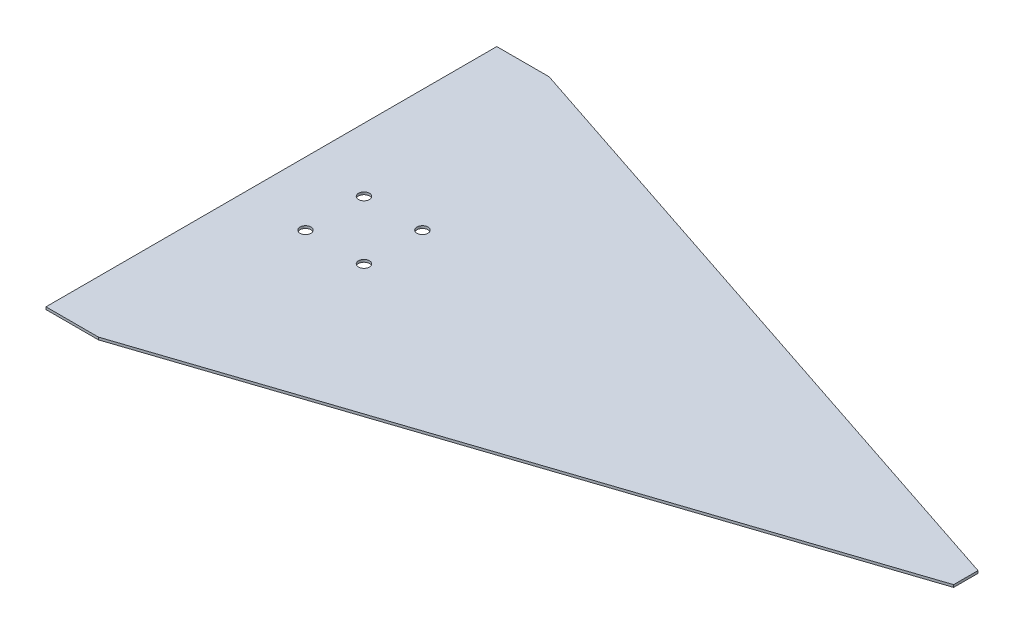
ISO-10303-21;
HEADER;
FILE_DESCRIPTION(('STEP AP214'),'2;1');
FILE_NAME('part.step','',(''),(''),'','','');
FILE_SCHEMA(('AUTOMOTIVE_DESIGN { 1 0 10303 214 1 1 1 1 }'));
ENDSEC;
DATA;
#1=APPLICATION_CONTEXT('core data for automotive mechanical design processes');
#2=APPLICATION_PROTOCOL_DEFINITION('international standard','automotive_design',2000,#1);
#3=PRODUCT_CONTEXT('',#1,'mechanical');
#4=PRODUCT('Part','Part','',(#3));
#5=PRODUCT_RELATED_PRODUCT_CATEGORY('part','',(#4));
#6=PRODUCT_DEFINITION_FORMATION('','',#4);
#7=PRODUCT_DEFINITION_CONTEXT('part definition',#1,'design');
#8=PRODUCT_DEFINITION('design','',#6,#7);
#9=PRODUCT_DEFINITION_SHAPE('','',#8);
#10=(LENGTH_UNIT() NAMED_UNIT(*) SI_UNIT(.MILLI.,.METRE.));
#11=(NAMED_UNIT(*) PLANE_ANGLE_UNIT() SI_UNIT($,.RADIAN.));
#12=(NAMED_UNIT(*) SI_UNIT($,.STERADIAN.) SOLID_ANGLE_UNIT());
#13=UNCERTAINTY_MEASURE_WITH_UNIT(LENGTH_MEASURE(1.E-05),#10,'distance_accuracy_value','');
#14=(GEOMETRIC_REPRESENTATION_CONTEXT(3) GLOBAL_UNCERTAINTY_ASSIGNED_CONTEXT((#13)) GLOBAL_UNIT_ASSIGNED_CONTEXT((#10,
#11,#12)) REPRESENTATION_CONTEXT('',''));
#15=CARTESIAN_POINT('',(0.,0.,0.));
#16=DIRECTION('',(0.,0.,1.));
#17=DIRECTION('',(1.,0.,0.));
#18=AXIS2_PLACEMENT_3D('',#15,#16,#17);
#19=CARTESIAN_POINT('',(0.,1.,92.5));
#20=DIRECTION('',(0.,0.,-1.));
#21=DIRECTION('',(-1.,0.,0.));
#22=AXIS2_PLACEMENT_3D('',#19,#20,#21);
#23=PLANE('',#22);
#24=DIRECTION('',(1.,0.,0.));
#25=VECTOR('',#24,1.);
#26=CARTESIAN_POINT('',(0.,0.,92.5));
#27=LINE('',#26,#25);
#28=CARTESIAN_POINT('',(-142.5,0.,92.5));
#29=VERTEX_POINT('',#28);
#30=CARTESIAN_POINT('',(-121.,0.,92.5));
#31=VERTEX_POINT('',#30);
#32=EDGE_CURVE('E115',#29,#31,#27,.T.);
#33=ORIENTED_EDGE('',*,*,#32,.T.);
#34=DIRECTION('',(0.,-1.,0.));
#35=VECTOR('',#34,1.);
#36=CARTESIAN_POINT('',(-121.,1.,92.5));
#37=LINE('',#36,#35);
#38=CARTESIAN_POINT('',(-121.,1.,92.5));
#39=VERTEX_POINT('',#38);
#40=EDGE_CURVE('E11',#39,#31,#37,.T.);
#41=ORIENTED_EDGE('',*,*,#40,.F.);
#42=DIRECTION('',(1.,0.,0.));
#43=VECTOR('',#42,1.);
#44=CARTESIAN_POINT('',(0.,1.,92.5));
#45=LINE('',#44,#43);
#46=CARTESIAN_POINT('',(-142.5,1.,92.5));
#47=VERTEX_POINT('',#46);
#48=EDGE_CURVE('E129',#47,#39,#45,.T.);
#49=ORIENTED_EDGE('',*,*,#48,.F.);
#50=DIRECTION('',(0.,-1.,0.));
#51=VECTOR('',#50,1.);
#52=CARTESIAN_POINT('',(-142.5,1.,92.5));
#53=LINE('',#52,#51);
#54=EDGE_CURVE('E111',#47,#29,#53,.T.);
#55=ORIENTED_EDGE('',*,*,#54,.T.);
#56=EDGE_LOOP('',(#33,#41,#49,#55));
#57=FACE_BOUND('',#56,.T.);
#58=ADVANCED_FACE('F33',(#57),#23,.F.);
#59=CARTESIAN_POINT('',(15.6482079039027,1.,47.1234603734669));
#60=DIRECTION('',(-0.315147056715353,0.,-0.949042850794236));
#61=DIRECTION('',(-0.949042850794236,0.,0.315147056715353));
#62=AXIS2_PLACEMENT_3D('',#59,#60,#61);
#63=PLANE('',#62);
#64=DIRECTION('',(0.949042850794236,0.,-0.315147056715353));
#65=VECTOR('',#64,1.);
#66=CARTESIAN_POINT('',(15.6482079039027,0.,47.1234603734669));
#67=LINE('',#66,#65);
#68=CARTESIAN_POINT('',(142.5,0.,5.));
#69=VERTEX_POINT('',#68);
#70=EDGE_CURVE('E118',#31,#69,#67,.T.);
#71=ORIENTED_EDGE('',*,*,#70,.T.);
#72=DIRECTION('',(0.,-1.,0.));
#73=VECTOR('',#72,1.);
#74=CARTESIAN_POINT('',(142.5,1.,5.));
#75=LINE('',#74,#73);
#76=CARTESIAN_POINT('',(142.5,1.,5.));
#77=VERTEX_POINT('',#76);
#78=EDGE_CURVE('E41',#77,#69,#75,.T.);
#79=ORIENTED_EDGE('',*,*,#78,.F.);
#80=DIRECTION('',(0.949042850794236,0.,-0.315147056715353));
#81=VECTOR('',#80,1.);
#82=CARTESIAN_POINT('',(15.6482079039027,1.,47.1234603734669));
#83=LINE('',#82,#81);
#84=EDGE_CURVE('E82',#39,#77,#83,.T.);
#85=ORIENTED_EDGE('',*,*,#84,.F.);
#86=ORIENTED_EDGE('',*,*,#40,.T.);
#87=EDGE_LOOP('',(#71,#79,#85,#86));
#88=FACE_BOUND('',#87,.T.);
#89=ADVANCED_FACE('F135',(#88),#63,.F.);
#90=CARTESIAN_POINT('',(142.5,1.,0.));
#91=DIRECTION('',(1.,0.,0.));
#92=DIRECTION('',(0.,0.,-1.));
#93=AXIS2_PLACEMENT_3D('',#90,#91,#92);
#94=PLANE('',#93);
#95=DIRECTION('',(0.,0.,1.));
#96=VECTOR('',#95,1.);
#97=CARTESIAN_POINT('',(142.5,0.,0.));
#98=LINE('',#97,#96);
#99=CARTESIAN_POINT('',(142.5,0.,-4.99999999999999));
#100=VERTEX_POINT('',#99);
#101=EDGE_CURVE('E122',#100,#69,#98,.T.);
#102=ORIENTED_EDGE('',*,*,#101,.F.);
#103=DIRECTION('',(0.,-1.,0.));
#104=VECTOR('',#103,1.);
#105=CARTESIAN_POINT('',(142.5,1.,-4.99999999999999));
#106=LINE('',#105,#104);
#107=CARTESIAN_POINT('',(142.5,1.,-4.99999999999999));
#108=VERTEX_POINT('',#107);
#109=EDGE_CURVE('E101',#108,#100,#106,.T.);
#110=ORIENTED_EDGE('',*,*,#109,.F.);
#111=DIRECTION('',(0.,0.,1.));
#112=VECTOR('',#111,1.);
#113=CARTESIAN_POINT('',(142.5,1.,0.));
#114=LINE('',#113,#112);
#115=EDGE_CURVE('E107',#108,#77,#114,.T.);
#116=ORIENTED_EDGE('',*,*,#115,.T.);
#117=ORIENTED_EDGE('',*,*,#78,.T.);
#118=EDGE_LOOP('',(#102,#110,#116,#117));
#119=FACE_BOUND('',#118,.T.);
#120=ADVANCED_FACE('F134',(#119),#94,.T.);
#121=CARTESIAN_POINT('',(15.6482079039027,1.,-47.1234603734669));
#122=DIRECTION('',(0.315147056715353,0.,-0.949042850794236));
#123=DIRECTION('',(-0.949042850794236,0.,-0.315147056715353));
#124=AXIS2_PLACEMENT_3D('',#121,#122,#123);
#125=PLANE('',#124);
#126=DIRECTION('',(0.949042850794236,0.,0.315147056715353));
#127=VECTOR('',#126,1.);
#128=CARTESIAN_POINT('',(15.6482079039027,0.,-47.1234603734669));
#129=LINE('',#128,#127);
#130=CARTESIAN_POINT('',(-121.,0.,-92.5));
#131=VERTEX_POINT('',#130);
#132=EDGE_CURVE('E96',#131,#100,#129,.T.);
#133=ORIENTED_EDGE('',*,*,#132,.F.);
#134=DIRECTION('',(0.,-1.,0.));
#135=VECTOR('',#134,1.);
#136=CARTESIAN_POINT('',(-121.,1.,-92.5));
#137=LINE('',#136,#135);
#138=CARTESIAN_POINT('',(-121.,1.,-92.5));
#139=VERTEX_POINT('',#138);
#140=EDGE_CURVE('E91',#139,#131,#137,.T.);
#141=ORIENTED_EDGE('',*,*,#140,.F.);
#142=DIRECTION('',(0.949042850794236,0.,0.315147056715353));
#143=VECTOR('',#142,1.);
#144=CARTESIAN_POINT('',(15.6482079039027,1.,-47.1234603734669));
#145=LINE('',#144,#143);
#146=EDGE_CURVE('E94',#139,#108,#145,.T.);
#147=ORIENTED_EDGE('',*,*,#146,.T.);
#148=ORIENTED_EDGE('',*,*,#109,.T.);
#149=EDGE_LOOP('',(#133,#141,#147,#148));
#150=FACE_BOUND('',#149,.T.);
#151=ADVANCED_FACE('F93',(#150),#125,.T.);
#152=CARTESIAN_POINT('',(0.,1.,-92.5));
#153=DIRECTION('',(0.,0.,-1.));
#154=DIRECTION('',(-1.,0.,0.));
#155=AXIS2_PLACEMENT_3D('',#152,#153,#154);
#156=PLANE('',#155);
#157=DIRECTION('',(1.,0.,0.));
#158=VECTOR('',#157,1.);
#159=CARTESIAN_POINT('',(0.,0.,-92.5));
#160=LINE('',#159,#158);
#161=CARTESIAN_POINT('',(-142.5,0.,-92.5));
#162=VERTEX_POINT('',#161);
#163=EDGE_CURVE('E126',#162,#131,#160,.T.);
#164=ORIENTED_EDGE('',*,*,#163,.F.);
#165=DIRECTION('',(0.,-1.,0.));
#166=VECTOR('',#165,1.);
#167=CARTESIAN_POINT('',(-142.5,1.,-92.5));
#168=LINE('',#167,#166);
#169=CARTESIAN_POINT('',(-142.5,1.,-92.5));
#170=VERTEX_POINT('',#169);
#171=EDGE_CURVE('E71',#170,#162,#168,.T.);
#172=ORIENTED_EDGE('',*,*,#171,.F.);
#173=DIRECTION('',(1.,0.,0.));
#174=VECTOR('',#173,1.);
#175=CARTESIAN_POINT('',(0.,1.,-92.5));
#176=LINE('',#175,#174);
#177=EDGE_CURVE('E105',#170,#139,#176,.T.);
#178=ORIENTED_EDGE('',*,*,#177,.T.);
#179=ORIENTED_EDGE('',*,*,#140,.T.);
#180=EDGE_LOOP('',(#164,#172,#178,#179));
#181=FACE_BOUND('',#180,.T.);
#182=ADVANCED_FACE('F109',(#181),#156,.T.);
#183=CARTESIAN_POINT('',(-142.5,1.,0.));
#184=DIRECTION('',(1.,0.,0.));
#185=DIRECTION('',(0.,0.,-1.));
#186=AXIS2_PLACEMENT_3D('',#183,#184,#185);
#187=PLANE('',#186);
#188=DIRECTION('',(0.,0.,1.));
#189=VECTOR('',#188,1.);
#190=CARTESIAN_POINT('',(-142.5,0.,0.));
#191=LINE('',#190,#189);
#192=EDGE_CURVE('E74',#162,#29,#191,.T.);
#193=ORIENTED_EDGE('',*,*,#192,.T.);
#194=ORIENTED_EDGE('',*,*,#54,.F.);
#195=DIRECTION('',(0.,0.,1.));
#196=VECTOR('',#195,1.);
#197=CARTESIAN_POINT('',(-142.5,1.,0.));
#198=LINE('',#197,#196);
#199=EDGE_CURVE('E49',#170,#47,#198,.T.);
#200=ORIENTED_EDGE('',*,*,#199,.F.);
#201=ORIENTED_EDGE('',*,*,#171,.T.);
#202=EDGE_LOOP('',(#193,#194,#200,#201));
#203=FACE_BOUND('',#202,.T.);
#204=ADVANCED_FACE('F142',(#203),#187,.F.);
#205=CARTESIAN_POINT('',(0.,1.,0.));
#206=DIRECTION('',(0.,1.,0.));
#207=DIRECTION('',(0.,0.,1.));
#208=AXIS2_PLACEMENT_3D('',#205,#206,#207);
#209=PLANE('',#208);
#210=CARTESIAN_POINT('',(-92.5,1.,-12.));
#211=DIRECTION('',(0.,1.,0.));
#212=DIRECTION('',(0.,0.,1.));
#213=AXIS2_PLACEMENT_3D('',#210,#211,#212);
#214=CIRCLE('',#213,2.25);
#215=CARTESIAN_POINT('',(-92.5,1.,-9.75000000000001));
#216=VERTEX_POINT('',#215);
#217=EDGE_CURVE('E237',#216,#216,#214,.T.);
#218=ORIENTED_EDGE('',*,*,#217,.F.);
#219=EDGE_LOOP('',(#218));
#220=FACE_BOUND('',#219,.T.);
#221=CARTESIAN_POINT('',(-116.5,1.,12.));
#222=DIRECTION('',(0.,1.,0.));
#223=DIRECTION('',(0.,0.,1.));
#224=AXIS2_PLACEMENT_3D('',#221,#222,#223);
#225=CIRCLE('',#224,2.25);
#226=CARTESIAN_POINT('',(-116.5,1.,14.25));
#227=VERTEX_POINT('',#226);
#228=EDGE_CURVE('E243',#227,#227,#225,.T.);
#229=ORIENTED_EDGE('',*,*,#228,.F.);
#230=EDGE_LOOP('',(#229));
#231=FACE_BOUND('',#230,.T.);
#232=CARTESIAN_POINT('',(-92.5,1.,12.));
#233=DIRECTION('',(0.,1.,0.));
#234=DIRECTION('',(0.,0.,1.));
#235=AXIS2_PLACEMENT_3D('',#232,#233,#234);
#236=CIRCLE('',#235,2.25);
#237=CARTESIAN_POINT('',(-92.5,1.,14.25));
#238=VERTEX_POINT('',#237);
#239=EDGE_CURVE('E263',#238,#238,#236,.T.);
#240=ORIENTED_EDGE('',*,*,#239,.F.);
#241=EDGE_LOOP('',(#240));
#242=FACE_BOUND('',#241,.T.);
#243=CARTESIAN_POINT('',(-116.5,1.,-12.));
#244=DIRECTION('',(0.,1.,0.));
#245=DIRECTION('',(0.,0.,1.));
#246=AXIS2_PLACEMENT_3D('',#243,#244,#245);
#247=CIRCLE('',#246,2.25);
#248=CARTESIAN_POINT('',(-116.5,1.,-9.75000000000001));
#249=VERTEX_POINT('',#248);
#250=EDGE_CURVE('E240',#249,#249,#247,.T.);
#251=ORIENTED_EDGE('',*,*,#250,.F.);
#252=EDGE_LOOP('',(#251));
#253=FACE_BOUND('',#252,.T.);
#254=ORIENTED_EDGE('',*,*,#48,.T.);
#255=ORIENTED_EDGE('',*,*,#84,.T.);
#256=ORIENTED_EDGE('',*,*,#115,.F.);
#257=ORIENTED_EDGE('',*,*,#146,.F.);
#258=ORIENTED_EDGE('',*,*,#177,.F.);
#259=ORIENTED_EDGE('',*,*,#199,.T.);
#260=EDGE_LOOP('',(#254,#255,#256,#257,#258,#259));
#261=FACE_BOUND('',#260,.T.);
#262=ADVANCED_FACE('F104',(#220,#231,#242,#253,#261),#209,.T.);
#263=CARTESIAN_POINT('',(0.,0.,0.));
#264=DIRECTION('',(0.,1.,0.));
#265=DIRECTION('',(0.,0.,1.));
#266=AXIS2_PLACEMENT_3D('',#263,#264,#265);
#267=PLANE('',#266);
#268=CARTESIAN_POINT('',(-92.5,0.,-12.));
#269=DIRECTION('',(0.,1.,0.));
#270=DIRECTION('',(0.,0.,1.));
#271=AXIS2_PLACEMENT_3D('',#268,#269,#270);
#272=CIRCLE('',#271,2.25);
#273=CARTESIAN_POINT('',(-92.5,0.,-9.75000000000001));
#274=VERTEX_POINT('',#273);
#275=EDGE_CURVE('E234',#274,#274,#272,.T.);
#276=ORIENTED_EDGE('',*,*,#275,.T.);
#277=EDGE_LOOP('',(#276));
#278=FACE_BOUND('',#277,.T.);
#279=CARTESIAN_POINT('',(-116.5,0.,12.));
#280=DIRECTION('',(0.,1.,0.));
#281=DIRECTION('',(0.,0.,1.));
#282=AXIS2_PLACEMENT_3D('',#279,#280,#281);
#283=CIRCLE('',#282,2.25);
#284=CARTESIAN_POINT('',(-116.5,0.,14.25));
#285=VERTEX_POINT('',#284);
#286=EDGE_CURVE('E238',#285,#285,#283,.T.);
#287=ORIENTED_EDGE('',*,*,#286,.T.);
#288=EDGE_LOOP('',(#287));
#289=FACE_BOUND('',#288,.T.);
#290=CARTESIAN_POINT('',(-92.5,0.,12.));
#291=DIRECTION('',(0.,1.,0.));
#292=DIRECTION('',(0.,0.,1.));
#293=AXIS2_PLACEMENT_3D('',#290,#291,#292);
#294=CIRCLE('',#293,2.25);
#295=CARTESIAN_POINT('',(-92.5,0.,14.25));
#296=VERTEX_POINT('',#295);
#297=EDGE_CURVE('E249',#296,#296,#294,.T.);
#298=ORIENTED_EDGE('',*,*,#297,.T.);
#299=EDGE_LOOP('',(#298));
#300=FACE_BOUND('',#299,.T.);
#301=CARTESIAN_POINT('',(-116.5,0.,-12.));
#302=DIRECTION('',(0.,1.,0.));
#303=DIRECTION('',(0.,0.,1.));
#304=AXIS2_PLACEMENT_3D('',#301,#302,#303);
#305=CIRCLE('',#304,2.25);
#306=CARTESIAN_POINT('',(-116.5,0.,-9.75000000000001));
#307=VERTEX_POINT('',#306);
#308=EDGE_CURVE('E119',#307,#307,#305,.T.);
#309=ORIENTED_EDGE('',*,*,#308,.T.);
#310=EDGE_LOOP('',(#309));
#311=FACE_BOUND('',#310,.T.);
#312=ORIENTED_EDGE('',*,*,#32,.F.);
#313=ORIENTED_EDGE('',*,*,#192,.F.);
#314=ORIENTED_EDGE('',*,*,#163,.T.);
#315=ORIENTED_EDGE('',*,*,#132,.T.);
#316=ORIENTED_EDGE('',*,*,#101,.T.);
#317=ORIENTED_EDGE('',*,*,#70,.F.);
#318=EDGE_LOOP('',(#312,#313,#314,#315,#316,#317));
#319=FACE_BOUND('',#318,.T.);
#320=ADVANCED_FACE('F139',(#278,#289,#300,#311,#319),#267,.F.);
#321=CARTESIAN_POINT('',(-116.5,0.,-12.));
#322=DIRECTION('',(0.,1.,0.));
#323=DIRECTION('',(0.,0.,1.));
#324=AXIS2_PLACEMENT_3D('',#321,#322,#323);
#325=CYLINDRICAL_SURFACE('',#324,2.25);
#326=ORIENTED_EDGE('',*,*,#308,.F.);
#327=EDGE_LOOP('',(#326));
#328=FACE_BOUND('',#327,.T.);
#329=ORIENTED_EDGE('',*,*,#250,.T.);
#330=EDGE_LOOP('',(#329));
#331=FACE_BOUND('',#330,.T.);
#332=ADVANCED_FACE('F189',(#328,#331),#325,.F.);
#333=CARTESIAN_POINT('',(-92.5,0.,12.));
#334=DIRECTION('',(0.,1.,0.));
#335=DIRECTION('',(0.,0.,1.));
#336=AXIS2_PLACEMENT_3D('',#333,#334,#335);
#337=CYLINDRICAL_SURFACE('',#336,2.25);
#338=ORIENTED_EDGE('',*,*,#297,.F.);
#339=EDGE_LOOP('',(#338));
#340=FACE_BOUND('',#339,.T.);
#341=ORIENTED_EDGE('',*,*,#239,.T.);
#342=EDGE_LOOP('',(#341));
#343=FACE_BOUND('',#342,.T.);
#344=ADVANCED_FACE('F197',(#340,#343),#337,.F.);
#345=CARTESIAN_POINT('',(-116.5,0.,12.));
#346=DIRECTION('',(0.,1.,0.));
#347=DIRECTION('',(0.,0.,1.));
#348=AXIS2_PLACEMENT_3D('',#345,#346,#347);
#349=CYLINDRICAL_SURFACE('',#348,2.25);
#350=ORIENTED_EDGE('',*,*,#286,.F.);
#351=EDGE_LOOP('',(#350));
#352=FACE_BOUND('',#351,.T.);
#353=ORIENTED_EDGE('',*,*,#228,.T.);
#354=EDGE_LOOP('',(#353));
#355=FACE_BOUND('',#354,.T.);
#356=ADVANCED_FACE('F207',(#352,#355),#349,.F.);
#357=CARTESIAN_POINT('',(-92.5,0.,-12.));
#358=DIRECTION('',(0.,1.,0.));
#359=DIRECTION('',(0.,0.,1.));
#360=AXIS2_PLACEMENT_3D('',#357,#358,#359);
#361=CYLINDRICAL_SURFACE('',#360,2.25);
#362=ORIENTED_EDGE('',*,*,#275,.F.);
#363=EDGE_LOOP('',(#362));
#364=FACE_BOUND('',#363,.T.);
#365=ORIENTED_EDGE('',*,*,#217,.T.);
#366=EDGE_LOOP('',(#365));
#367=FACE_BOUND('',#366,.T.);
#368=ADVANCED_FACE('F217',(#364,#367),#361,.F.);
#369=CLOSED_SHELL('',(#58,#89,#120,#151,#182,#204,#262,#320,#332,#344,#356,#368));
#370=MANIFOLD_SOLID_BREP('B2',#369);
#371=ADVANCED_BREP_SHAPE_REPRESENTATION('',(#18,#370),#14);
#372=SHAPE_DEFINITION_REPRESENTATION(#9,#371);
ENDSEC;
END-ISO-10303-21;
